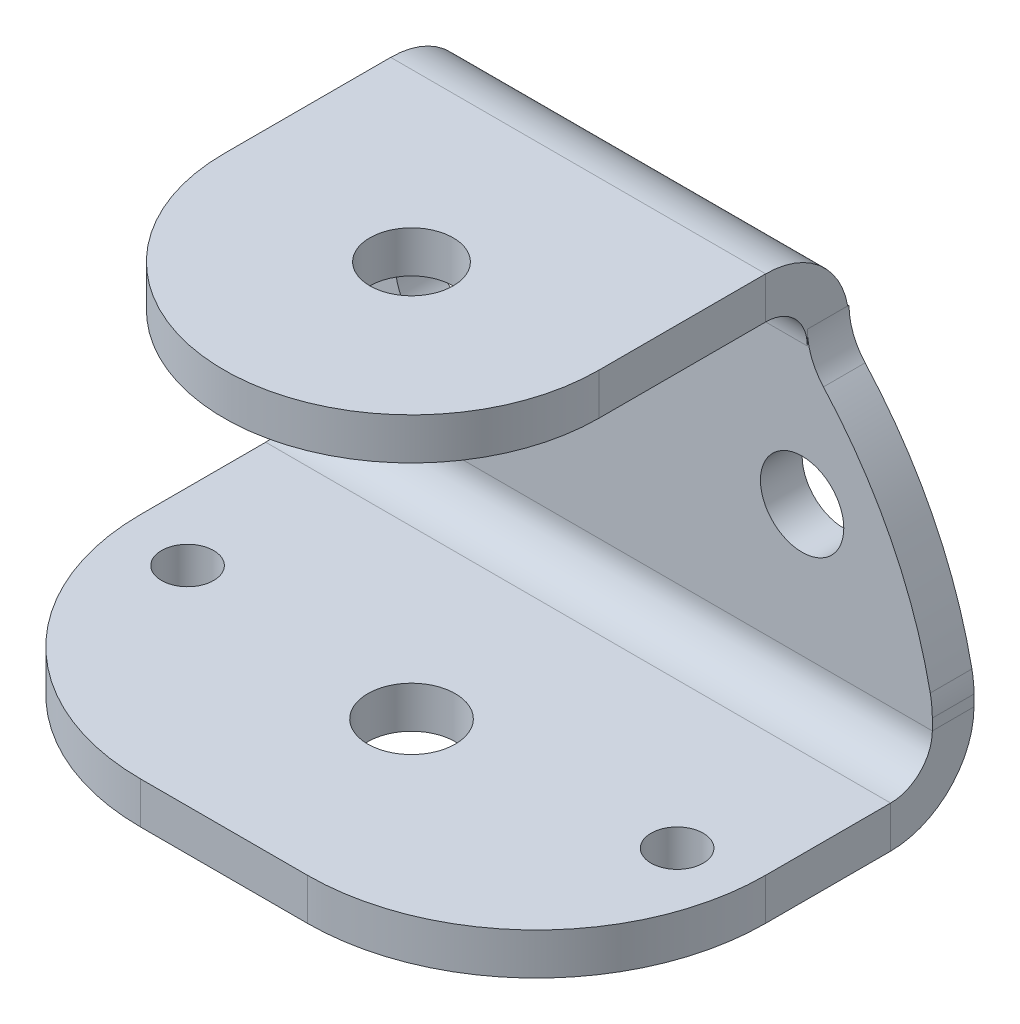
ISO-10303-21;
HEADER;
FILE_DESCRIPTION(('STEP AP214'),'2;1');
FILE_NAME('part.step','',(''),(''),'','','');
FILE_SCHEMA(('AUTOMOTIVE_DESIGN { 1 0 10303 214 1 1 1 1 }'));
ENDSEC;
DATA;
#1=APPLICATION_CONTEXT('core data for automotive mechanical design processes');
#2=APPLICATION_PROTOCOL_DEFINITION('international standard','automotive_design',2000,#1);
#3=PRODUCT_CONTEXT('',#1,'mechanical');
#4=PRODUCT('Part','Part','',(#3));
#5=PRODUCT_RELATED_PRODUCT_CATEGORY('part','',(#4));
#6=PRODUCT_DEFINITION_FORMATION('','',#4);
#7=PRODUCT_DEFINITION_CONTEXT('part definition',#1,'design');
#8=PRODUCT_DEFINITION('design','',#6,#7);
#9=PRODUCT_DEFINITION_SHAPE('','',#8);
#10=(LENGTH_UNIT() NAMED_UNIT(*) SI_UNIT(.MILLI.,.METRE.));
#11=(NAMED_UNIT(*) PLANE_ANGLE_UNIT() SI_UNIT($,.RADIAN.));
#12=(NAMED_UNIT(*) SI_UNIT($,.STERADIAN.) SOLID_ANGLE_UNIT());
#13=UNCERTAINTY_MEASURE_WITH_UNIT(LENGTH_MEASURE(1.E-05),#10,'distance_accuracy_value','');
#14=(GEOMETRIC_REPRESENTATION_CONTEXT(3) GLOBAL_UNCERTAINTY_ASSIGNED_CONTEXT((#13)) GLOBAL_UNIT_ASSIGNED_CONTEXT((#10,
#11,#12)) REPRESENTATION_CONTEXT('',''));
#15=CARTESIAN_POINT('',(0.,0.,0.));
#16=DIRECTION('',(0.,0.,1.));
#17=DIRECTION('',(1.,0.,0.));
#18=AXIS2_PLACEMENT_3D('',#15,#16,#17);
#19=CARTESIAN_POINT('',(15.,19.,9.99999999999999));
#20=DIRECTION('',(0.,1.,0.));
#21=DIRECTION('',(0.,0.,1.));
#22=AXIS2_PLACEMENT_3D('',#19,#20,#21);
#23=PLANE('',#22);
#24=DIRECTION('',(0.,0.,-1.));
#25=VECTOR('',#24,1.);
#26=CARTESIAN_POINT('',(24.,19.,0.));
#27=LINE('',#26,#25);
#28=CARTESIAN_POINT('',(24.,19.,9.99999999999999));
#29=VERTEX_POINT('',#28);
#30=CARTESIAN_POINT('',(24.,19.,1.99999999999999));
#31=VERTEX_POINT('',#30);
#32=EDGE_CURVE('E210',#29,#31,#27,.T.);
#33=ORIENTED_EDGE('',*,*,#32,.T.);
#34=DIRECTION('',(-1.,0.,0.));
#35=VECTOR('',#34,1.);
#36=CARTESIAN_POINT('',(15.,19.,1.99999999999999));
#37=LINE('',#36,#35);
#38=CARTESIAN_POINT('',(6.,19.,1.99999999999999));
#39=VERTEX_POINT('',#38);
#40=EDGE_CURVE('E207',#31,#39,#37,.T.);
#41=ORIENTED_EDGE('',*,*,#40,.T.);
#42=DIRECTION('',(0.,0.,1.));
#43=VECTOR('',#42,1.);
#44=CARTESIAN_POINT('',(6.,19.,10.));
#45=LINE('',#44,#43);
#46=CARTESIAN_POINT('',(6.,19.,10.));
#47=VERTEX_POINT('',#46);
#48=EDGE_CURVE('E199',#39,#47,#45,.T.);
#49=ORIENTED_EDGE('',*,*,#48,.T.);
#50=CARTESIAN_POINT('',(15.,19.,9.99999999999999));
#51=DIRECTION('',(0.,1.,0.));
#52=DIRECTION('',(0.,0.,1.));
#53=AXIS2_PLACEMENT_3D('',#50,#51,#52);
#54=CIRCLE('',#53,9.);
#55=EDGE_CURVE('E204',#47,#29,#54,.T.);
#56=ORIENTED_EDGE('',*,*,#55,.T.);
#57=EDGE_LOOP('',(#33,#41,#49,#56));
#58=FACE_BOUND('',#57,.T.);
#59=CARTESIAN_POINT('',(15.,19.,10.0000000000001));
#60=DIRECTION('',(0.,1.,0.));
#61=DIRECTION('',(0.,0.,1.));
#62=AXIS2_PLACEMENT_3D('',#59,#60,#61);
#63=CIRCLE('',#62,2.);
#64=CARTESIAN_POINT('',(15.,19.,12.0000000000001));
#65=VERTEX_POINT('',#64);
#66=EDGE_CURVE('E909',#65,#65,#63,.T.);
#67=ORIENTED_EDGE('',*,*,#66,.F.);
#68=EDGE_LOOP('',(#67));
#69=FACE_BOUND('',#68,.T.);
#70=ADVANCED_FACE('F42',(#58,#69),#23,.T.);
#71=CARTESIAN_POINT('',(15.,17.,10.));
#72=DIRECTION('',(0.,1.,0.));
#73=DIRECTION('',(0.,0.,1.));
#74=AXIS2_PLACEMENT_3D('',#71,#72,#73);
#75=PLANE('',#74);
#76=DIRECTION('',(-1.,0.,0.));
#77=VECTOR('',#76,1.);
#78=CARTESIAN_POINT('',(24.,17.,1.99999999999999));
#79=LINE('',#78,#77);
#80=CARTESIAN_POINT('',(24.,17.,1.99999999999999));
#81=VERTEX_POINT('',#80);
#82=CARTESIAN_POINT('',(6.,17.,1.99999999999999));
#83=VERTEX_POINT('',#82);
#84=EDGE_CURVE('E868',#81,#83,#79,.T.);
#85=ORIENTED_EDGE('',*,*,#84,.F.);
#86=DIRECTION('',(0.,0.,-1.));
#87=VECTOR('',#86,1.);
#88=CARTESIAN_POINT('',(24.,17.,0.));
#89=LINE('',#88,#87);
#90=CARTESIAN_POINT('',(24.,17.,10.));
#91=VERTEX_POINT('',#90);
#92=EDGE_CURVE('E229',#91,#81,#89,.T.);
#93=ORIENTED_EDGE('',*,*,#92,.F.);
#94=CARTESIAN_POINT('',(15.,17.,10.));
#95=DIRECTION('',(0.,1.,0.));
#96=DIRECTION('',(0.,0.,1.));
#97=AXIS2_PLACEMENT_3D('',#94,#95,#96);
#98=CIRCLE('',#97,9.);
#99=CARTESIAN_POINT('',(6.,17.,10.));
#100=VERTEX_POINT('',#99);
#101=EDGE_CURVE('E233',#100,#91,#98,.T.);
#102=ORIENTED_EDGE('',*,*,#101,.F.);
#103=DIRECTION('',(0.,0.,1.));
#104=VECTOR('',#103,1.);
#105=CARTESIAN_POINT('',(6.,17.,10.));
#106=LINE('',#105,#104);
#107=EDGE_CURVE('E216',#83,#100,#106,.T.);
#108=ORIENTED_EDGE('',*,*,#107,.F.);
#109=EDGE_LOOP('',(#85,#93,#102,#108));
#110=FACE_BOUND('',#109,.T.);
#111=CARTESIAN_POINT('',(15.,17.,10.0000000000001));
#112=DIRECTION('',(0.,1.,0.));
#113=DIRECTION('',(0.,0.,1.));
#114=AXIS2_PLACEMENT_3D('',#111,#112,#113);
#115=CIRCLE('',#114,2.);
#116=CARTESIAN_POINT('',(15.,17.,12.0000000000001));
#117=VERTEX_POINT('',#116);
#118=EDGE_CURVE('E912',#117,#117,#115,.T.);
#119=ORIENTED_EDGE('',*,*,#118,.T.);
#120=EDGE_LOOP('',(#119));
#121=FACE_BOUND('',#120,.T.);
#122=ADVANCED_FACE('F438',(#110,#121),#75,.F.);
#123=CARTESIAN_POINT('',(24.,15.,0.));
#124=DIRECTION('',(-1.,0.,0.));
#125=DIRECTION('',(0.,0.,1.));
#126=AXIS2_PLACEMENT_3D('',#123,#124,#125);
#127=PLANE('',#126);
#128=DIRECTION('',(0.,-1.,0.));
#129=VECTOR('',#128,1.);
#130=CARTESIAN_POINT('',(24.,-0.747058324957094,-2.));
#131=LINE('',#130,#129);
#132=CARTESIAN_POINT('',(24.,15.6981268922314,-2.));
#133=VERTEX_POINT('',#132);
#134=CARTESIAN_POINT('',(24.,15.,-2.));
#135=VERTEX_POINT('',#134);
#136=EDGE_CURVE('E255',#133,#135,#131,.T.);
#137=ORIENTED_EDGE('',*,*,#136,.T.);
#138=CARTESIAN_POINT('',(24.,15.,2.));
#139=DIRECTION('',(-1.,0.,0.));
#140=DIRECTION('',(0.,0.,1.));
#141=AXIS2_PLACEMENT_3D('',#138,#139,#140);
#142=CIRCLE('',#141,4.);
#143=CARTESIAN_POINT('',(24.,15.6981268922314,-1.93860620554318));
#144=VERTEX_POINT('',#143);
#145=EDGE_CURVE('E239',#135,#144,#142,.F.);
#146=ORIENTED_EDGE('',*,*,#145,.T.);
#147=DIRECTION('',(0.,0.,-1.));
#148=VECTOR('',#147,1.);
#149=CARTESIAN_POINT('',(24.,15.6981268922314,-2.));
#150=LINE('',#149,#148);
#151=EDGE_CURVE('E358',#144,#133,#150,.T.);
#152=ORIENTED_EDGE('',*,*,#151,.T.);
#153=EDGE_LOOP('',(#137,#146,#152));
#154=FACE_BOUND('',#153,.T.);
#155=ADVANCED_FACE('F443',(#154),#127,.T.);
#156=CARTESIAN_POINT('',(30.,0.,-2.));
#157=DIRECTION('',(1.,0.,0.));
#158=DIRECTION('',(0.,0.,-1.));
#159=AXIS2_PLACEMENT_3D('',#156,#157,#158);
#160=PLANE('',#159);
#161=DIRECTION('',(0.,1.,0.));
#162=VECTOR('',#161,1.);
#163=CARTESIAN_POINT('',(30.,0.,0.));
#164=LINE('',#163,#162);
#165=CARTESIAN_POINT('',(30.,1.99999999999999,0.));
#166=VERTEX_POINT('',#165);
#167=CARTESIAN_POINT('',(30.,2.53240768629767,0.));
#168=VERTEX_POINT('',#167);
#169=EDGE_CURVE('E324',#166,#168,#164,.T.);
#170=ORIENTED_EDGE('',*,*,#169,.F.);
#171=DIRECTION('',(0.,0.,-1.));
#172=VECTOR('',#171,1.);
#173=CARTESIAN_POINT('',(30.,1.99999999999999,0.));
#174=LINE('',#173,#172);
#175=CARTESIAN_POINT('',(30.,1.99999999999999,-2.));
#176=VERTEX_POINT('',#175);
#177=EDGE_CURVE('E293',#166,#176,#174,.T.);
#178=ORIENTED_EDGE('',*,*,#177,.T.);
#179=DIRECTION('',(0.,1.,0.));
#180=VECTOR('',#179,1.);
#181=CARTESIAN_POINT('',(30.,0.,-2.));
#182=LINE('',#181,#180);
#183=CARTESIAN_POINT('',(30.,2.53240768629767,-2.));
#184=VERTEX_POINT('',#183);
#185=EDGE_CURVE('E313',#176,#184,#182,.T.);
#186=ORIENTED_EDGE('',*,*,#185,.T.);
#187=DIRECTION('',(0.,0.,1.));
#188=VECTOR('',#187,1.);
#189=CARTESIAN_POINT('',(30.,2.53240768629767,-2.));
#190=LINE('',#189,#188);
#191=EDGE_CURVE('E321',#184,#168,#190,.T.);
#192=ORIENTED_EDGE('',*,*,#191,.T.);
#193=EDGE_LOOP('',(#170,#178,#186,#192));
#194=FACE_BOUND('',#193,.T.);
#195=ADVANCED_FACE('F477',(#194),#160,.T.);
#196=CARTESIAN_POINT('',(8.79730487716558,-0.747058324957094,-2.));
#197=DIRECTION('',(0.,0.,1.));
#198=DIRECTION('',(1.,0.,0.));
#199=AXIS2_PLACEMENT_3D('',#196,#197,#198);
#200=PLANE('',#199);
#201=CARTESIAN_POINT('',(23.75,8.29999999999993,-2.));
#202=DIRECTION('',(0.,0.,-1.));
#203=DIRECTION('',(-1.,0.,0.));
#204=AXIS2_PLACEMENT_3D('',#201,#202,#203);
#205=CIRCLE('',#204,2.);
#206=CARTESIAN_POINT('',(21.75,8.29999999999993,-2.));
#207=VERTEX_POINT('',#206);
#208=EDGE_CURVE('E883',#207,#207,#205,.T.);
#209=ORIENTED_EDGE('',*,*,#208,.F.);
#210=EDGE_LOOP('',(#209));
#211=FACE_BOUND('',#210,.T.);
#212=CARTESIAN_POINT('',(6.25,8.29999999999994,-2.));
#213=DIRECTION('',(0.,0.,-1.));
#214=DIRECTION('',(-1.,0.,0.));
#215=AXIS2_PLACEMENT_3D('',#212,#213,#214);
#216=CIRCLE('',#215,2.);
#217=CARTESIAN_POINT('',(4.25,8.29999999999994,-2.));
#218=VERTEX_POINT('',#217);
#219=EDGE_CURVE('E877',#218,#218,#216,.T.);
#220=ORIENTED_EDGE('',*,*,#219,.F.);
#221=EDGE_LOOP('',(#220));
#222=FACE_BOUND('',#221,.T.);
#223=CARTESIAN_POINT('',(3.,15.6981268922314,-2.));
#224=DIRECTION('',(0.,0.,1.));
#225=DIRECTION('',(1.,0.,0.));
#226=AXIS2_PLACEMENT_3D('',#223,#224,#225);
#227=CIRCLE('',#226,3.);
#228=CARTESIAN_POINT('',(5.22606207871607,13.6869959612122,-2.));
#229=VERTEX_POINT('',#228);
#230=CARTESIAN_POINT('',(6.,15.6981268922314,-2.));
#231=VERTEX_POINT('',#230);
#232=EDGE_CURVE('E364',#229,#231,#227,.T.);
#233=ORIENTED_EDGE('',*,*,#232,.T.);
#234=DIRECTION('',(0.,-1.,0.));
#235=VECTOR('',#234,1.);
#236=CARTESIAN_POINT('',(6.,-0.747058324957094,-2.));
#237=LINE('',#236,#235);
#238=CARTESIAN_POINT('',(6.,15.,-2.));
#239=VERTEX_POINT('',#238);
#240=EDGE_CURVE('E260',#231,#239,#237,.T.);
#241=ORIENTED_EDGE('',*,*,#240,.T.);
#242=DIRECTION('',(-1.,0.,0.));
#243=VECTOR('',#242,1.);
#244=CARTESIAN_POINT('',(6.,15.,-2.));
#245=LINE('',#244,#243);
#246=EDGE_CURVE('E235',#239,#135,#245,.F.);
#247=ORIENTED_EDGE('',*,*,#246,.T.);
#248=ORIENTED_EDGE('',*,*,#136,.F.);
#249=CARTESIAN_POINT('',(27.,15.6981268922314,-2.));
#250=DIRECTION('',(0.,0.,1.));
#251=DIRECTION('',(1.,0.,0.));
#252=AXIS2_PLACEMENT_3D('',#249,#250,#251);
#253=CIRCLE('',#252,3.);
#254=CARTESIAN_POINT('',(24.7739379212839,13.6869959612122,-2.));
#255=VERTEX_POINT('',#254);
#256=EDGE_CURVE('E369',#133,#255,#253,.T.);
#257=ORIENTED_EDGE('',*,*,#256,.T.);
#258=CARTESIAN_POINT('',(8.79730487716558,-0.747058324957094,-2.));
#259=DIRECTION('',(0.,0.,1.));
#260=DIRECTION('',(1.,0.,0.));
#261=AXIS2_PLACEMENT_3D('',#258,#259,#260);
#262=CIRCLE('',#261,21.5312499999999);
#263=CARTESIAN_POINT('',(29.9006261241087,3.52430666890781,-2.));
#264=VERTEX_POINT('',#263);
#265=EDGE_CURVE('E316',#264,#255,#262,.T.);
#266=ORIENTED_EDGE('',*,*,#265,.F.);
#267=CARTESIAN_POINT('',(25.,2.53240768629767,-2.));
#268=DIRECTION('',(0.,0.,1.));
#269=DIRECTION('',(1.,0.,0.));
#270=AXIS2_PLACEMENT_3D('',#267,#268,#269);
#271=CIRCLE('',#270,5.);
#272=EDGE_CURVE('E341',#264,#184,#271,.F.);
#273=ORIENTED_EDGE('',*,*,#272,.T.);
#274=ORIENTED_EDGE('',*,*,#185,.F.);
#275=DIRECTION('',(1.,0.,0.));
#276=VECTOR('',#275,1.);
#277=CARTESIAN_POINT('',(30.,1.99999999999999,-2.));
#278=LINE('',#277,#276);
#279=CARTESIAN_POINT('',(0.,2.00000000000001,-2.));
#280=VERTEX_POINT('',#279);
#281=EDGE_CURVE('E287',#176,#280,#278,.F.);
#282=ORIENTED_EDGE('',*,*,#281,.T.);
#283=DIRECTION('',(0.,-1.,0.));
#284=VECTOR('',#283,1.);
#285=CARTESIAN_POINT('',(0.,3.,-2.));
#286=LINE('',#285,#284);
#287=CARTESIAN_POINT('',(0.,2.53240768629769,-2.));
#288=VERTEX_POINT('',#287);
#289=EDGE_CURVE('E310',#288,#280,#286,.T.);
#290=ORIENTED_EDGE('',*,*,#289,.F.);
#291=CARTESIAN_POINT('',(5.,2.53240768629769,-2.));
#292=DIRECTION('',(0.,0.,1.));
#293=DIRECTION('',(1.,0.,0.));
#294=AXIS2_PLACEMENT_3D('',#291,#292,#293);
#295=CIRCLE('',#294,5.);
#296=CARTESIAN_POINT('',(0.0993738758912691,3.52430666890783,-2.));
#297=VERTEX_POINT('',#296);
#298=EDGE_CURVE('E338',#288,#297,#295,.F.);
#299=ORIENTED_EDGE('',*,*,#298,.T.);
#300=CARTESIAN_POINT('',(21.2026951228344,-0.747058324957094,-2.));
#301=DIRECTION('',(0.,0.,1.));
#302=DIRECTION('',(-1.,0.,0.));
#303=AXIS2_PLACEMENT_3D('',#300,#301,#302);
#304=CIRCLE('',#303,21.5312499999999);
#305=EDGE_CURVE('E319',#229,#297,#304,.T.);
#306=ORIENTED_EDGE('',*,*,#305,.F.);
#307=EDGE_LOOP('',(#233,#241,#247,#248,#257,#266,#273,#274,#282,#290,#299,#306));
#308=FACE_BOUND('',#307,.T.);
#309=ADVANCED_FACE('F741',(#211,#222,#308),#200,.F.);
#310=CARTESIAN_POINT('',(8.79730487716558,-0.747058324957094,0.));
#311=DIRECTION('',(0.,0.,1.));
#312=DIRECTION('',(1.,0.,0.));
#313=AXIS2_PLACEMENT_3D('',#310,#311,#312);
#314=PLANE('',#313);
#315=CARTESIAN_POINT('',(23.75,8.29999999999993,0.));
#316=DIRECTION('',(0.,0.,1.));
#317=DIRECTION('',(1.,0.,0.));
#318=AXIS2_PLACEMENT_3D('',#315,#316,#317);
#319=CIRCLE('',#318,2.);
#320=CARTESIAN_POINT('',(25.75,8.29999999999993,0.));
#321=VERTEX_POINT('',#320);
#322=EDGE_CURVE('E886',#321,#321,#319,.F.);
#323=ORIENTED_EDGE('',*,*,#322,.T.);
#324=EDGE_LOOP('',(#323));
#325=FACE_BOUND('',#324,.T.);
#326=CARTESIAN_POINT('',(6.25,8.29999999999994,0.));
#327=DIRECTION('',(0.,0.,1.));
#328=DIRECTION('',(1.,0.,0.));
#329=AXIS2_PLACEMENT_3D('',#326,#327,#328);
#330=CIRCLE('',#329,2.);
#331=CARTESIAN_POINT('',(8.25,8.29999999999994,0.));
#332=VERTEX_POINT('',#331);
#333=EDGE_CURVE('E880',#332,#332,#330,.F.);
#334=ORIENTED_EDGE('',*,*,#333,.T.);
#335=EDGE_LOOP('',(#334));
#336=FACE_BOUND('',#335,.T.);
#337=DIRECTION('',(0.,1.,0.));
#338=VECTOR('',#337,1.);
#339=CARTESIAN_POINT('',(6.,15.,0.));
#340=LINE('',#339,#338);
#341=CARTESIAN_POINT('',(6.,15.,0.));
#342=VERTEX_POINT('',#341);
#343=CARTESIAN_POINT('',(6.,15.6981268922314,0.));
#344=VERTEX_POINT('',#343);
#345=EDGE_CURVE('E253',#342,#344,#340,.T.);
#346=ORIENTED_EDGE('',*,*,#345,.T.);
#347=CARTESIAN_POINT('',(3.,15.6981268922314,0.));
#348=DIRECTION('',(0.,0.,1.));
#349=DIRECTION('',(1.,0.,0.));
#350=AXIS2_PLACEMENT_3D('',#347,#348,#349);
#351=CIRCLE('',#350,3.);
#352=CARTESIAN_POINT('',(5.22606207871607,13.6869959612122,0.));
#353=VERTEX_POINT('',#352);
#354=EDGE_CURVE('E362',#344,#353,#351,.F.);
#355=ORIENTED_EDGE('',*,*,#354,.T.);
#356=CARTESIAN_POINT('',(21.2026951228344,-0.747058324957094,0.));
#357=DIRECTION('',(0.,0.,1.));
#358=DIRECTION('',(-1.,0.,0.));
#359=AXIS2_PLACEMENT_3D('',#356,#357,#358);
#360=CIRCLE('',#359,21.5312499999999);
#361=CARTESIAN_POINT('',(0.0993738758912691,3.52430666890783,0.));
#362=VERTEX_POINT('',#361);
#363=EDGE_CURVE('E314',#353,#362,#360,.T.);
#364=ORIENTED_EDGE('',*,*,#363,.T.);
#365=CARTESIAN_POINT('',(5.,2.53240768629769,0.));
#366=DIRECTION('',(0.,0.,1.));
#367=DIRECTION('',(1.,0.,0.));
#368=AXIS2_PLACEMENT_3D('',#365,#366,#367);
#369=CIRCLE('',#368,5.);
#370=CARTESIAN_POINT('',(0.,2.53240768629769,0.));
#371=VERTEX_POINT('',#370);
#372=EDGE_CURVE('E332',#362,#371,#369,.T.);
#373=ORIENTED_EDGE('',*,*,#372,.T.);
#374=DIRECTION('',(0.,-1.,0.));
#375=VECTOR('',#374,1.);
#376=CARTESIAN_POINT('',(0.,3.,0.));
#377=LINE('',#376,#375);
#378=CARTESIAN_POINT('',(0.,1.99999999999999,0.));
#379=VERTEX_POINT('',#378);
#380=EDGE_CURVE('E307',#371,#379,#377,.T.);
#381=ORIENTED_EDGE('',*,*,#380,.T.);
#382=DIRECTION('',(1.,0.,0.));
#383=VECTOR('',#382,1.);
#384=CARTESIAN_POINT('',(30.,1.99999999999999,0.));
#385=LINE('',#384,#383);
#386=EDGE_CURVE('E299',#166,#379,#385,.F.);
#387=ORIENTED_EDGE('',*,*,#386,.F.);
#388=ORIENTED_EDGE('',*,*,#169,.T.);
#389=CARTESIAN_POINT('',(25.,2.53240768629767,0.));
#390=DIRECTION('',(0.,0.,1.));
#391=DIRECTION('',(1.,0.,0.));
#392=AXIS2_PLACEMENT_3D('',#389,#390,#391);
#393=CIRCLE('',#392,5.);
#394=CARTESIAN_POINT('',(29.9006261241087,3.52430666890781,0.));
#395=VERTEX_POINT('',#394);
#396=EDGE_CURVE('E334',#168,#395,#393,.T.);
#397=ORIENTED_EDGE('',*,*,#396,.T.);
#398=CARTESIAN_POINT('',(8.79730487716558,-0.747058324957094,0.));
#399=DIRECTION('',(0.,0.,1.));
#400=DIRECTION('',(1.,0.,0.));
#401=AXIS2_PLACEMENT_3D('',#398,#399,#400);
#402=CIRCLE('',#401,21.5312499999999);
#403=CARTESIAN_POINT('',(24.7739379212839,13.6869959612122,0.));
#404=VERTEX_POINT('',#403);
#405=EDGE_CURVE('E326',#395,#404,#402,.T.);
#406=ORIENTED_EDGE('',*,*,#405,.T.);
#407=CARTESIAN_POINT('',(27.,15.6981268922314,0.));
#408=DIRECTION('',(0.,0.,1.));
#409=DIRECTION('',(1.,0.,0.));
#410=AXIS2_PLACEMENT_3D('',#407,#408,#409);
#411=CIRCLE('',#410,3.);
#412=CARTESIAN_POINT('',(24.,15.6981268922314,0.));
#413=VERTEX_POINT('',#412);
#414=EDGE_CURVE('E366',#404,#413,#411,.F.);
#415=ORIENTED_EDGE('',*,*,#414,.T.);
#416=DIRECTION('',(0.,1.,0.));
#417=VECTOR('',#416,1.);
#418=CARTESIAN_POINT('',(24.,15.,0.));
#419=LINE('',#418,#417);
#420=CARTESIAN_POINT('',(24.,15.,0.));
#421=VERTEX_POINT('',#420);
#422=EDGE_CURVE('E241',#421,#413,#419,.T.);
#423=ORIENTED_EDGE('',*,*,#422,.F.);
#424=DIRECTION('',(-1.,0.,0.));
#425=VECTOR('',#424,1.);
#426=CARTESIAN_POINT('',(6.,15.,0.));
#427=LINE('',#426,#425);
#428=EDGE_CURVE('E248',#342,#421,#427,.F.);
#429=ORIENTED_EDGE('',*,*,#428,.F.);
#430=EDGE_LOOP('',(#346,#355,#364,#373,#381,#387,#388,#397,#406,#415,#423,#429));
#431=FACE_BOUND('',#430,.T.);
#432=ADVANCED_FACE('F423',(#325,#336,#431),#314,.T.);
#433=CARTESIAN_POINT('',(0.,3.,-2.));
#434=DIRECTION('',(-1.,0.,0.));
#435=DIRECTION('',(0.,-1.,0.));
#436=AXIS2_PLACEMENT_3D('',#433,#434,#435);
#437=PLANE('',#436);
#438=DIRECTION('',(0.,0.,-1.));
#439=VECTOR('',#438,1.);
#440=CARTESIAN_POINT('',(0.,1.99999999999999,0.));
#441=LINE('',#440,#439);
#442=EDGE_CURVE('E304',#379,#280,#441,.T.);
#443=ORIENTED_EDGE('',*,*,#442,.F.);
#444=ORIENTED_EDGE('',*,*,#380,.F.);
#445=DIRECTION('',(0.,0.,1.));
#446=VECTOR('',#445,1.);
#447=CARTESIAN_POINT('',(0.,2.53240768629769,-2.));
#448=LINE('',#447,#446);
#449=EDGE_CURVE('E347',#371,#288,#448,.F.);
#450=ORIENTED_EDGE('',*,*,#449,.T.);
#451=ORIENTED_EDGE('',*,*,#289,.T.);
#452=EDGE_LOOP('',(#443,#444,#450,#451));
#453=FACE_BOUND('',#452,.T.);
#454=ADVANCED_FACE('F419',(#453),#437,.T.);
#455=CARTESIAN_POINT('',(21.2026951228344,-0.747058324957094,-2.));
#456=DIRECTION('',(0.,0.,1.));
#457=DIRECTION('',(1.,0.,0.));
#458=AXIS2_PLACEMENT_3D('',#455,#456,#457);
#459=CYLINDRICAL_SURFACE('',#458,21.5312499999999);
#460=ORIENTED_EDGE('',*,*,#363,.F.);
#461=DIRECTION('',(0.,0.,1.));
#462=VECTOR('',#461,1.);
#463=CARTESIAN_POINT('',(5.22606207871607,13.6869959612122,-2.));
#464=LINE('',#463,#462);
#465=EDGE_CURVE('E353',#353,#229,#464,.F.);
#466=ORIENTED_EDGE('',*,*,#465,.T.);
#467=ORIENTED_EDGE('',*,*,#305,.T.);
#468=DIRECTION('',(0.,0.,1.));
#469=VECTOR('',#468,1.);
#470=CARTESIAN_POINT('',(0.0993738758912691,3.52430666890783,-2.));
#471=LINE('',#470,#469);
#472=EDGE_CURVE('E344',#297,#362,#471,.T.);
#473=ORIENTED_EDGE('',*,*,#472,.T.);
#474=EDGE_LOOP('',(#460,#466,#467,#473));
#475=FACE_BOUND('',#474,.T.);
#476=ADVANCED_FACE('F803',(#475),#459,.T.);
#477=CARTESIAN_POINT('',(8.79730487716558,-0.747058324957094,-2.));
#478=DIRECTION('',(0.,0.,1.));
#479=DIRECTION('',(1.,0.,0.));
#480=AXIS2_PLACEMENT_3D('',#477,#478,#479);
#481=CYLINDRICAL_SURFACE('',#480,21.5312499999999);
#482=ORIENTED_EDGE('',*,*,#265,.T.);
#483=DIRECTION('',(0.,0.,1.));
#484=VECTOR('',#483,1.);
#485=CARTESIAN_POINT('',(24.7739379212839,13.6869959612122,-2.));
#486=LINE('',#485,#484);
#487=EDGE_CURVE('E355',#255,#404,#486,.T.);
#488=ORIENTED_EDGE('',*,*,#487,.T.);
#489=ORIENTED_EDGE('',*,*,#405,.F.);
#490=DIRECTION('',(0.,0.,1.));
#491=VECTOR('',#490,1.);
#492=CARTESIAN_POINT('',(29.9006261241087,3.52430666890781,-2.));
#493=LINE('',#492,#491);
#494=EDGE_CURVE('E336',#395,#264,#493,.F.);
#495=ORIENTED_EDGE('',*,*,#494,.T.);
#496=EDGE_LOOP('',(#482,#488,#489,#495));
#497=FACE_BOUND('',#496,.T.);
#498=ADVANCED_FACE('F794',(#497),#481,.T.);
#499=CARTESIAN_POINT('',(25.,2.53240768629767,-2.));
#500=DIRECTION('',(0.,0.,1.));
#501=DIRECTION('',(1.,0.,0.));
#502=AXIS2_PLACEMENT_3D('',#499,#500,#501);
#503=CYLINDRICAL_SURFACE('',#502,5.);
#504=ORIENTED_EDGE('',*,*,#272,.F.);
#505=ORIENTED_EDGE('',*,*,#494,.F.);
#506=ORIENTED_EDGE('',*,*,#396,.F.);
#507=ORIENTED_EDGE('',*,*,#191,.F.);
#508=EDGE_LOOP('',(#504,#505,#506,#507));
#509=FACE_BOUND('',#508,.T.);
#510=ADVANCED_FACE('F784',(#509),#503,.T.);
#511=CARTESIAN_POINT('',(5.,2.53240768629769,-2.));
#512=DIRECTION('',(0.,0.,1.));
#513=DIRECTION('',(1.,0.,0.));
#514=AXIS2_PLACEMENT_3D('',#511,#512,#513);
#515=CYLINDRICAL_SURFACE('',#514,5.);
#516=ORIENTED_EDGE('',*,*,#298,.F.);
#517=ORIENTED_EDGE('',*,*,#449,.F.);
#518=ORIENTED_EDGE('',*,*,#372,.F.);
#519=ORIENTED_EDGE('',*,*,#472,.F.);
#520=EDGE_LOOP('',(#516,#517,#518,#519));
#521=FACE_BOUND('',#520,.T.);
#522=ADVANCED_FACE('F775',(#521),#515,.T.);
#523=CARTESIAN_POINT('',(3.,15.6981268922314,-2.));
#524=DIRECTION('',(0.,0.,1.));
#525=DIRECTION('',(1.,0.,0.));
#526=AXIS2_PLACEMENT_3D('',#523,#524,#525);
#527=CYLINDRICAL_SURFACE('',#526,3.);
#528=ORIENTED_EDGE('',*,*,#232,.F.);
#529=ORIENTED_EDGE('',*,*,#465,.F.);
#530=ORIENTED_EDGE('',*,*,#354,.F.);
#531=DIRECTION('',(0.,0.,-1.));
#532=VECTOR('',#531,1.);
#533=CARTESIAN_POINT('',(6.,15.6981268922314,0.));
#534=LINE('',#533,#532);
#535=CARTESIAN_POINT('',(6.,15.6981268922314,-1.93860620554318));
#536=VERTEX_POINT('',#535);
#537=EDGE_CURVE('E349',#536,#344,#534,.F.);
#538=ORIENTED_EDGE('',*,*,#537,.F.);
#539=EDGE_CURVE('E350',#231,#536,#534,.F.);
#540=ORIENTED_EDGE('',*,*,#539,.F.);
#541=EDGE_LOOP('',(#528,#529,#530,#538,#540));
#542=FACE_BOUND('',#541,.T.);
#543=ADVANCED_FACE('F767',(#542),#527,.F.);
#544=CARTESIAN_POINT('',(27.,15.6981268922314,-2.));
#545=DIRECTION('',(0.,0.,1.));
#546=DIRECTION('',(1.,0.,0.));
#547=AXIS2_PLACEMENT_3D('',#544,#545,#546);
#548=CYLINDRICAL_SURFACE('',#547,3.);
#549=ORIENTED_EDGE('',*,*,#256,.F.);
#550=ORIENTED_EDGE('',*,*,#151,.F.);
#551=EDGE_CURVE('E359',#413,#144,#150,.T.);
#552=ORIENTED_EDGE('',*,*,#551,.F.);
#553=ORIENTED_EDGE('',*,*,#414,.F.);
#554=ORIENTED_EDGE('',*,*,#487,.F.);
#555=EDGE_LOOP('',(#549,#550,#552,#553,#554));
#556=FACE_BOUND('',#555,.T.);
#557=ADVANCED_FACE('F732',(#556),#548,.F.);
#558=CARTESIAN_POINT('',(0.,1.99999999999999,2.));
#559=DIRECTION('',(-1.,0.,0.));
#560=DIRECTION('',(0.,0.,1.));
#561=AXIS2_PLACEMENT_3D('',#558,#559,#560);
#562=PLANE('',#561);
#563=DIRECTION('',(0.,-1.,0.));
#564=VECTOR('',#563,1.);
#565=CARTESIAN_POINT('',(0.,0.,1.99999999999999));
#566=LINE('',#565,#564);
#567=CARTESIAN_POINT('',(0.,0.,1.99999999999999));
#568=VERTEX_POINT('',#567);
#569=CARTESIAN_POINT('',(0.,-2.00000000000001,1.99999999999999));
#570=VERTEX_POINT('',#569);
#571=EDGE_CURVE('E263',#568,#570,#566,.T.);
#572=ORIENTED_EDGE('',*,*,#571,.F.);
#573=CARTESIAN_POINT('',(0.,1.99999999999999,2.));
#574=DIRECTION('',(1.,0.,0.));
#575=DIRECTION('',(0.,0.,-1.));
#576=AXIS2_PLACEMENT_3D('',#573,#574,#575);
#577=CIRCLE('',#576,2.);
#578=EDGE_CURVE('E296',#379,#568,#577,.F.);
#579=ORIENTED_EDGE('',*,*,#578,.F.);
#580=ORIENTED_EDGE('',*,*,#442,.T.);
#581=CARTESIAN_POINT('',(0.,1.99999999999999,2.));
#582=DIRECTION('',(1.,0.,0.));
#583=DIRECTION('',(0.,0.,-1.));
#584=AXIS2_PLACEMENT_3D('',#581,#582,#583);
#585=CIRCLE('',#584,4.);
#586=EDGE_CURVE('E289',#280,#570,#585,.F.);
#587=ORIENTED_EDGE('',*,*,#586,.T.);
#588=EDGE_LOOP('',(#572,#579,#580,#587));
#589=FACE_BOUND('',#588,.T.);
#590=ADVANCED_FACE('F415',(#589),#562,.T.);
#591=CARTESIAN_POINT('',(30.,1.99999999999999,2.));
#592=DIRECTION('',(-1.,0.,0.));
#593=DIRECTION('',(0.,0.,1.));
#594=AXIS2_PLACEMENT_3D('',#591,#592,#593);
#595=PLANE('',#594);
#596=CARTESIAN_POINT('',(30.,1.99999999999999,2.));
#597=DIRECTION('',(1.,0.,0.));
#598=DIRECTION('',(0.,0.,-1.));
#599=AXIS2_PLACEMENT_3D('',#596,#597,#598);
#600=CIRCLE('',#599,2.);
#601=CARTESIAN_POINT('',(30.,0.,1.99999999999999));
#602=VERTEX_POINT('',#601);
#603=EDGE_CURVE('E282',#602,#166,#600,.T.);
#604=ORIENTED_EDGE('',*,*,#603,.F.);
#605=DIRECTION('',(0.,-1.,0.));
#606=VECTOR('',#605,1.);
#607=CARTESIAN_POINT('',(30.,0.,1.99999999999999));
#608=LINE('',#607,#606);
#609=CARTESIAN_POINT('',(30.,-2.00000000000001,1.99999999999999));
#610=VERTEX_POINT('',#609);
#611=EDGE_CURVE('E266',#602,#610,#608,.T.);
#612=ORIENTED_EDGE('',*,*,#611,.T.);
#613=CARTESIAN_POINT('',(30.,1.99999999999999,2.));
#614=DIRECTION('',(1.,0.,0.));
#615=DIRECTION('',(0.,0.,-1.));
#616=AXIS2_PLACEMENT_3D('',#613,#614,#615);
#617=CIRCLE('',#616,4.);
#618=EDGE_CURVE('E290',#610,#176,#617,.T.);
#619=ORIENTED_EDGE('',*,*,#618,.T.);
#620=ORIENTED_EDGE('',*,*,#177,.F.);
#621=EDGE_LOOP('',(#604,#612,#619,#620));
#622=FACE_BOUND('',#621,.T.);
#623=ADVANCED_FACE('F408',(#622),#595,.F.);
#624=CARTESIAN_POINT('',(30.,1.99999999999999,2.));
#625=DIRECTION('',(1.,0.,0.));
#626=DIRECTION('',(0.,-1.,0.));
#627=AXIS2_PLACEMENT_3D('',#624,#625,#626);
#628=CYLINDRICAL_SURFACE('',#627,4.);
#629=ORIENTED_EDGE('',*,*,#281,.F.);
#630=ORIENTED_EDGE('',*,*,#618,.F.);
#631=DIRECTION('',(-1.,0.,0.));
#632=VECTOR('',#631,1.);
#633=CARTESIAN_POINT('',(0.,-2.00000000000001,1.99999999999999));
#634=LINE('',#633,#632);
#635=EDGE_CURVE('E269',#610,#570,#634,.T.);
#636=ORIENTED_EDGE('',*,*,#635,.T.);
#637=ORIENTED_EDGE('',*,*,#586,.F.);
#638=EDGE_LOOP('',(#629,#630,#636,#637));
#639=FACE_BOUND('',#638,.T.);
#640=ADVANCED_FACE('F413',(#639),#628,.T.);
#641=CARTESIAN_POINT('',(30.,1.99999999999999,2.));
#642=DIRECTION('',(1.,0.,0.));
#643=DIRECTION('',(0.,-1.,0.));
#644=AXIS2_PLACEMENT_3D('',#641,#642,#643);
#645=CYLINDRICAL_SURFACE('',#644,2.);
#646=ORIENTED_EDGE('',*,*,#386,.T.);
#647=ORIENTED_EDGE('',*,*,#578,.T.);
#648=DIRECTION('',(1.,0.,0.));
#649=VECTOR('',#648,1.);
#650=CARTESIAN_POINT('',(0.,0.,1.99999999999999));
#651=LINE('',#650,#649);
#652=EDGE_CURVE('E264',#568,#602,#651,.T.);
#653=ORIENTED_EDGE('',*,*,#652,.T.);
#654=ORIENTED_EDGE('',*,*,#603,.T.);
#655=EDGE_LOOP('',(#646,#647,#653,#654));
#656=FACE_BOUND('',#655,.T.);
#657=ADVANCED_FACE('F427',(#656),#645,.F.);
#658=CARTESIAN_POINT('',(0.,-2.,0.));
#659=DIRECTION('',(1.,0.,0.));
#660=DIRECTION('',(0.,0.,-1.));
#661=AXIS2_PLACEMENT_3D('',#658,#659,#660);
#662=PLANE('',#661);
#663=DIRECTION('',(0.,0.,-1.));
#664=VECTOR('',#663,1.);
#665=CARTESIAN_POINT('',(0.,-2.,0.));
#666=LINE('',#665,#664);
#667=CARTESIAN_POINT('',(0.,-2.00000000000003,7.99999999999999));
#668=VERTEX_POINT('',#667);
#669=EDGE_CURVE('E275',#668,#570,#666,.T.);
#670=ORIENTED_EDGE('',*,*,#669,.F.);
#671=DIRECTION('',(0.,1.,0.));
#672=VECTOR('',#671,1.);
#673=CARTESIAN_POINT('',(0.,-2.00000000000003,7.99999999999999));
#674=LINE('',#673,#672);
#675=CARTESIAN_POINT('',(0.,0.,8.));
#676=VERTEX_POINT('',#675);
#677=EDGE_CURVE('E371',#668,#676,#674,.T.);
#678=ORIENTED_EDGE('',*,*,#677,.T.);
#679=DIRECTION('',(0.,0.,-1.));
#680=VECTOR('',#679,1.);
#681=CARTESIAN_POINT('',(0.,0.,0.));
#682=LINE('',#681,#680);
#683=EDGE_CURVE('E274',#676,#568,#682,.T.);
#684=ORIENTED_EDGE('',*,*,#683,.T.);
#685=ORIENTED_EDGE('',*,*,#571,.T.);
#686=EDGE_LOOP('',(#670,#678,#684,#685));
#687=FACE_BOUND('',#686,.T.);
#688=ADVANCED_FACE('F391',(#687),#662,.F.);
#689=CARTESIAN_POINT('',(30.,-2.00000000000007,19.));
#690=DIRECTION('',(-1.,0.,0.));
#691=DIRECTION('',(0.,0.,1.));
#692=AXIS2_PLACEMENT_3D('',#689,#690,#691);
#693=PLANE('',#692);
#694=DIRECTION('',(0.,0.,1.));
#695=VECTOR('',#694,1.);
#696=CARTESIAN_POINT('',(30.,0.,19.));
#697=LINE('',#696,#695);
#698=CARTESIAN_POINT('',(30.,0.,8.));
#699=VERTEX_POINT('',#698);
#700=EDGE_CURVE('E284',#602,#699,#697,.T.);
#701=ORIENTED_EDGE('',*,*,#700,.T.);
#702=DIRECTION('',(0.,1.,0.));
#703=VECTOR('',#702,1.);
#704=CARTESIAN_POINT('',(30.,-2.00000000000003,7.99999999999999));
#705=LINE('',#704,#703);
#706=CARTESIAN_POINT('',(30.,-2.00000000000003,7.99999999999999));
#707=VERTEX_POINT('',#706);
#708=EDGE_CURVE('E12',#699,#707,#705,.F.);
#709=ORIENTED_EDGE('',*,*,#708,.T.);
#710=DIRECTION('',(0.,0.,1.));
#711=VECTOR('',#710,1.);
#712=CARTESIAN_POINT('',(30.,-2.00000000000007,19.));
#713=LINE('',#712,#711);
#714=EDGE_CURVE('E277',#610,#707,#713,.T.);
#715=ORIENTED_EDGE('',*,*,#714,.F.);
#716=ORIENTED_EDGE('',*,*,#611,.F.);
#717=EDGE_LOOP('',(#701,#709,#715,#716));
#718=FACE_BOUND('',#717,.T.);
#719=ADVANCED_FACE('F405',(#718),#693,.F.);
#720=CARTESIAN_POINT('',(0.,-2.,0.));
#721=DIRECTION('',(0.,1.,0.));
#722=DIRECTION('',(0.,0.,1.));
#723=AXIS2_PLACEMENT_3D('',#720,#721,#722);
#724=PLANE('',#723);
#725=CARTESIAN_POINT('',(15.,-2.00000000000004,9.99999999999999));
#726=DIRECTION('',(0.,1.,0.));
#727=DIRECTION('',(0.,0.,1.));
#728=AXIS2_PLACEMENT_3D('',#725,#726,#727);
#729=CIRCLE('',#728,2.1);
#730=CARTESIAN_POINT('',(15.,-2.00000000000004,12.1));
#731=VERTEX_POINT('',#730);
#732=EDGE_CURVE('E903',#731,#731,#729,.T.);
#733=ORIENTED_EDGE('',*,*,#732,.T.);
#734=EDGE_LOOP('',(#733));
#735=FACE_BOUND('',#734,.T.);
#736=CARTESIAN_POINT('',(3.25,-2.00000000000003,8.99999999999999));
#737=DIRECTION('',(0.,1.,0.));
#738=DIRECTION('',(0.,0.,1.));
#739=AXIS2_PLACEMENT_3D('',#736,#737,#738);
#740=CIRCLE('',#739,1.24999999999999);
#741=CARTESIAN_POINT('',(3.25,-2.00000000000004,10.25));
#742=VERTEX_POINT('',#741);
#743=EDGE_CURVE('E897',#742,#742,#740,.T.);
#744=ORIENTED_EDGE('',*,*,#743,.T.);
#745=EDGE_LOOP('',(#744));
#746=FACE_BOUND('',#745,.T.);
#747=CARTESIAN_POINT('',(26.75,-2.00000000000003,8.99999999999998));
#748=DIRECTION('',(0.,1.,0.));
#749=DIRECTION('',(0.,0.,1.));
#750=AXIS2_PLACEMENT_3D('',#747,#748,#749);
#751=CIRCLE('',#750,1.24999999999999);
#752=CARTESIAN_POINT('',(26.75,-2.00000000000004,10.25));
#753=VERTEX_POINT('',#752);
#754=EDGE_CURVE('E889',#753,#753,#751,.T.);
#755=ORIENTED_EDGE('',*,*,#754,.T.);
#756=EDGE_LOOP('',(#755));
#757=FACE_BOUND('',#756,.T.);
#758=DIRECTION('',(-1.,0.,0.));
#759=VECTOR('',#758,1.);
#760=CARTESIAN_POINT('',(0.,-2.00000000000007,19.));
#761=LINE('',#760,#759);
#762=CARTESIAN_POINT('',(19.,-2.00000000000007,19.));
#763=VERTEX_POINT('',#762);
#764=CARTESIAN_POINT('',(11.,-2.00000000000007,19.));
#765=VERTEX_POINT('',#764);
#766=EDGE_CURVE('E280',#763,#765,#761,.T.);
#767=ORIENTED_EDGE('',*,*,#766,.T.);
#768=CARTESIAN_POINT('',(11.,-2.00000000000003,7.99999999999999));
#769=DIRECTION('',(0.,1.,0.));
#770=DIRECTION('',(0.,0.,1.));
#771=AXIS2_PLACEMENT_3D('',#768,#769,#770);
#772=CIRCLE('',#771,11.);
#773=EDGE_CURVE('E50',#765,#668,#772,.F.);
#774=ORIENTED_EDGE('',*,*,#773,.T.);
#775=ORIENTED_EDGE('',*,*,#669,.T.);
#776=ORIENTED_EDGE('',*,*,#635,.F.);
#777=ORIENTED_EDGE('',*,*,#714,.T.);
#778=CARTESIAN_POINT('',(19.,-2.00000000000003,7.99999999999999));
#779=DIRECTION('',(0.,1.,0.));
#780=DIRECTION('',(0.,0.,1.));
#781=AXIS2_PLACEMENT_3D('',#778,#779,#780);
#782=CIRCLE('',#781,11.);
#783=EDGE_CURVE('E382',#707,#763,#782,.F.);
#784=ORIENTED_EDGE('',*,*,#783,.T.);
#785=EDGE_LOOP('',(#767,#774,#775,#776,#777,#784));
#786=FACE_BOUND('',#785,.T.);
#787=ADVANCED_FACE('F386',(#735,#746,#757,#786),#724,.F.);
#788=CARTESIAN_POINT('',(0.,0.,0.));
#789=DIRECTION('',(0.,1.,0.));
#790=DIRECTION('',(0.,0.,1.));
#791=AXIS2_PLACEMENT_3D('',#788,#789,#790);
#792=PLANE('',#791);
#793=CARTESIAN_POINT('',(15.,0.,9.99999999999999));
#794=DIRECTION('',(0.,1.,0.));
#795=DIRECTION('',(0.,0.,1.));
#796=AXIS2_PLACEMENT_3D('',#793,#794,#795);
#797=CIRCLE('',#796,2.1);
#798=CARTESIAN_POINT('',(15.,0.,12.1));
#799=VERTEX_POINT('',#798);
#800=EDGE_CURVE('E906',#799,#799,#797,.T.);
#801=ORIENTED_EDGE('',*,*,#800,.F.);
#802=EDGE_LOOP('',(#801));
#803=FACE_BOUND('',#802,.T.);
#804=CARTESIAN_POINT('',(3.25,0.,8.99999999999999));
#805=DIRECTION('',(0.,1.,0.));
#806=DIRECTION('',(0.,0.,1.));
#807=AXIS2_PLACEMENT_3D('',#804,#805,#806);
#808=CIRCLE('',#807,1.24999999999999);
#809=CARTESIAN_POINT('',(3.25,0.,10.25));
#810=VERTEX_POINT('',#809);
#811=EDGE_CURVE('E900',#810,#810,#808,.T.);
#812=ORIENTED_EDGE('',*,*,#811,.F.);
#813=EDGE_LOOP('',(#812));
#814=FACE_BOUND('',#813,.T.);
#815=CARTESIAN_POINT('',(26.75,0.,8.99999999999999));
#816=DIRECTION('',(0.,1.,0.));
#817=DIRECTION('',(0.,0.,1.));
#818=AXIS2_PLACEMENT_3D('',#815,#816,#817);
#819=CIRCLE('',#818,1.24999999999999);
#820=CARTESIAN_POINT('',(26.75,0.,10.25));
#821=VERTEX_POINT('',#820);
#822=EDGE_CURVE('E894',#821,#821,#819,.T.);
#823=ORIENTED_EDGE('',*,*,#822,.F.);
#824=EDGE_LOOP('',(#823));
#825=FACE_BOUND('',#824,.T.);
#826=ORIENTED_EDGE('',*,*,#683,.F.);
#827=CARTESIAN_POINT('',(11.,0.,8.));
#828=DIRECTION('',(0.,1.,0.));
#829=DIRECTION('',(0.,0.,1.));
#830=AXIS2_PLACEMENT_3D('',#827,#828,#829);
#831=CIRCLE('',#830,11.);
#832=CARTESIAN_POINT('',(11.,0.,19.));
#833=VERTEX_POINT('',#832);
#834=EDGE_CURVE('E376',#676,#833,#831,.T.);
#835=ORIENTED_EDGE('',*,*,#834,.T.);
#836=DIRECTION('',(-1.,0.,0.));
#837=VECTOR('',#836,1.);
#838=CARTESIAN_POINT('',(0.,0.,19.));
#839=LINE('',#838,#837);
#840=CARTESIAN_POINT('',(19.,0.,19.));
#841=VERTEX_POINT('',#840);
#842=EDGE_CURVE('E278',#841,#833,#839,.T.);
#843=ORIENTED_EDGE('',*,*,#842,.F.);
#844=CARTESIAN_POINT('',(19.,0.,8.));
#845=DIRECTION('',(0.,1.,0.));
#846=DIRECTION('',(0.,0.,1.));
#847=AXIS2_PLACEMENT_3D('',#844,#845,#846);
#848=CIRCLE('',#847,11.);
#849=EDGE_CURVE('E374',#841,#699,#848,.T.);
#850=ORIENTED_EDGE('',*,*,#849,.T.);
#851=ORIENTED_EDGE('',*,*,#700,.F.);
#852=ORIENTED_EDGE('',*,*,#652,.F.);
#853=EDGE_LOOP('',(#826,#835,#843,#850,#851,#852));
#854=FACE_BOUND('',#853,.T.);
#855=ADVANCED_FACE('F397',(#803,#814,#825,#854),#792,.T.);
#856=CARTESIAN_POINT('',(0.,-2.00000000000007,19.));
#857=DIRECTION('',(0.,0.,-1.));
#858=DIRECTION('',(0.,1.,0.));
#859=AXIS2_PLACEMENT_3D('',#856,#857,#858);
#860=PLANE('',#859);
#861=ORIENTED_EDGE('',*,*,#842,.T.);
#862=DIRECTION('',(0.,1.,0.));
#863=VECTOR('',#862,1.);
#864=CARTESIAN_POINT('',(11.,-2.00000000000007,19.));
#865=LINE('',#864,#863);
#866=EDGE_CURVE('E63',#833,#765,#865,.F.);
#867=ORIENTED_EDGE('',*,*,#866,.T.);
#868=ORIENTED_EDGE('',*,*,#766,.F.);
#869=DIRECTION('',(0.,1.,0.));
#870=VECTOR('',#869,1.);
#871=CARTESIAN_POINT('',(19.,-2.00000000000007,19.));
#872=LINE('',#871,#870);
#873=EDGE_CURVE('E378',#763,#841,#872,.T.);
#874=ORIENTED_EDGE('',*,*,#873,.T.);
#875=EDGE_LOOP('',(#861,#867,#868,#874));
#876=FACE_BOUND('',#875,.T.);
#877=ADVANCED_FACE('F399',(#876),#860,.F.);
#878=CARTESIAN_POINT('',(6.,15.,0.));
#879=DIRECTION('',(-1.,0.,0.));
#880=DIRECTION('',(0.,0.,1.));
#881=AXIS2_PLACEMENT_3D('',#878,#879,#880);
#882=PLANE('',#881);
#883=ORIENTED_EDGE('',*,*,#539,.T.);
#884=CARTESIAN_POINT('',(6.,15.,2.));
#885=DIRECTION('',(-1.,0.,0.));
#886=DIRECTION('',(0.,0.,1.));
#887=AXIS2_PLACEMENT_3D('',#884,#885,#886);
#888=CIRCLE('',#887,4.);
#889=EDGE_CURVE('E245',#536,#239,#888,.T.);
#890=ORIENTED_EDGE('',*,*,#889,.T.);
#891=ORIENTED_EDGE('',*,*,#240,.F.);
#892=EDGE_LOOP('',(#883,#890,#891));
#893=FACE_BOUND('',#892,.T.);
#894=ADVANCED_FACE('F470',(#893),#882,.F.);
#895=CARTESIAN_POINT('',(24.,15.,2.));
#896=DIRECTION('',(1.,0.,0.));
#897=DIRECTION('',(0.,0.,-1.));
#898=AXIS2_PLACEMENT_3D('',#895,#896,#897);
#899=PLANE('',#898);
#900=ORIENTED_EDGE('',*,*,#422,.T.);
#901=ORIENTED_EDGE('',*,*,#551,.T.);
#902=EDGE_CURVE('E237',#144,#31,#142,.F.);
#903=ORIENTED_EDGE('',*,*,#902,.T.);
#904=DIRECTION('',(0.,1.,0.));
#905=VECTOR('',#904,1.);
#906=CARTESIAN_POINT('',(24.,17.,1.99999999999999));
#907=LINE('',#906,#905);
#908=EDGE_CURVE('E866',#81,#31,#907,.T.);
#909=ORIENTED_EDGE('',*,*,#908,.F.);
#910=CARTESIAN_POINT('',(24.,15.,2.));
#911=DIRECTION('',(-1.,0.,0.));
#912=DIRECTION('',(0.,0.,1.));
#913=AXIS2_PLACEMENT_3D('',#910,#911,#912);
#914=CIRCLE('',#913,2.);
#915=EDGE_CURVE('E244',#421,#81,#914,.F.);
#916=ORIENTED_EDGE('',*,*,#915,.F.);
#917=EDGE_LOOP('',(#900,#901,#903,#909,#916));
#918=FACE_BOUND('',#917,.T.);
#919=ADVANCED_FACE('F467',(#918),#899,.T.);
#920=CARTESIAN_POINT('',(6.,15.,2.));
#921=DIRECTION('',(1.,0.,0.));
#922=DIRECTION('',(0.,0.,-1.));
#923=AXIS2_PLACEMENT_3D('',#920,#921,#922);
#924=PLANE('',#923);
#925=EDGE_CURVE('E238',#39,#536,#888,.T.);
#926=ORIENTED_EDGE('',*,*,#925,.T.);
#927=ORIENTED_EDGE('',*,*,#537,.T.);
#928=ORIENTED_EDGE('',*,*,#345,.F.);
#929=CARTESIAN_POINT('',(6.,15.,2.));
#930=DIRECTION('',(-1.,0.,0.));
#931=DIRECTION('',(0.,0.,1.));
#932=AXIS2_PLACEMENT_3D('',#929,#930,#931);
#933=CIRCLE('',#932,2.);
#934=EDGE_CURVE('E219',#83,#342,#933,.T.);
#935=ORIENTED_EDGE('',*,*,#934,.F.);
#936=DIRECTION('',(0.,1.,0.));
#937=VECTOR('',#936,1.);
#938=CARTESIAN_POINT('',(6.,17.,1.99999999999999));
#939=LINE('',#938,#937);
#940=EDGE_CURVE('E872',#83,#39,#939,.T.);
#941=ORIENTED_EDGE('',*,*,#940,.T.);
#942=EDGE_LOOP('',(#926,#927,#928,#935,#941));
#943=FACE_BOUND('',#942,.T.);
#944=ADVANCED_FACE('F462',(#943),#924,.F.);
#945=CARTESIAN_POINT('',(6.,15.,2.));
#946=DIRECTION('',(-1.,0.,0.));
#947=DIRECTION('',(0.,1.,0.));
#948=AXIS2_PLACEMENT_3D('',#945,#946,#947);
#949=CYLINDRICAL_SURFACE('',#948,4.);
#950=ORIENTED_EDGE('',*,*,#246,.F.);
#951=ORIENTED_EDGE('',*,*,#889,.F.);
#952=ORIENTED_EDGE('',*,*,#925,.F.);
#953=ORIENTED_EDGE('',*,*,#40,.F.);
#954=ORIENTED_EDGE('',*,*,#902,.F.);
#955=ORIENTED_EDGE('',*,*,#145,.F.);
#956=EDGE_LOOP('',(#950,#951,#952,#953,#954,#955));
#957=FACE_BOUND('',#956,.T.);
#958=ADVANCED_FACE('F459',(#957),#949,.T.);
#959=CARTESIAN_POINT('',(6.,15.,2.));
#960=DIRECTION('',(-1.,0.,0.));
#961=DIRECTION('',(0.,1.,0.));
#962=AXIS2_PLACEMENT_3D('',#959,#960,#961);
#963=CYLINDRICAL_SURFACE('',#962,2.);
#964=ORIENTED_EDGE('',*,*,#428,.T.);
#965=ORIENTED_EDGE('',*,*,#915,.T.);
#966=ORIENTED_EDGE('',*,*,#84,.T.);
#967=ORIENTED_EDGE('',*,*,#934,.T.);
#968=EDGE_LOOP('',(#964,#965,#966,#967));
#969=FACE_BOUND('',#968,.T.);
#970=ADVANCED_FACE('F457',(#969),#963,.F.);
#971=CARTESIAN_POINT('',(24.,19.,0.));
#972=DIRECTION('',(-1.,0.,0.));
#973=DIRECTION('',(0.,0.,1.));
#974=AXIS2_PLACEMENT_3D('',#971,#972,#973);
#975=PLANE('',#974);
#976=ORIENTED_EDGE('',*,*,#908,.T.);
#977=ORIENTED_EDGE('',*,*,#32,.F.);
#978=DIRECTION('',(0.,-1.,0.));
#979=VECTOR('',#978,1.);
#980=CARTESIAN_POINT('',(24.,19.,9.99999999999999));
#981=LINE('',#980,#979);
#982=EDGE_CURVE('E220',#29,#91,#981,.T.);
#983=ORIENTED_EDGE('',*,*,#982,.T.);
#984=ORIENTED_EDGE('',*,*,#92,.T.);
#985=EDGE_LOOP('',(#976,#977,#983,#984));
#986=FACE_BOUND('',#985,.T.);
#987=ADVANCED_FACE('F454',(#986),#975,.F.);
#988=CARTESIAN_POINT('',(6.,19.,10.));
#989=DIRECTION('',(1.,0.,0.));
#990=DIRECTION('',(0.,0.,-1.));
#991=AXIS2_PLACEMENT_3D('',#988,#989,#990);
#992=PLANE('',#991);
#993=ORIENTED_EDGE('',*,*,#940,.F.);
#994=ORIENTED_EDGE('',*,*,#107,.T.);
#995=DIRECTION('',(0.,-1.,0.));
#996=VECTOR('',#995,1.);
#997=CARTESIAN_POINT('',(6.,19.,10.));
#998=LINE('',#997,#996);
#999=EDGE_CURVE('E213',#47,#100,#998,.T.);
#1000=ORIENTED_EDGE('',*,*,#999,.F.);
#1001=ORIENTED_EDGE('',*,*,#48,.F.);
#1002=EDGE_LOOP('',(#993,#994,#1000,#1001));
#1003=FACE_BOUND('',#1002,.T.);
#1004=ADVANCED_FACE('F214',(#1003),#992,.F.);
#1005=CARTESIAN_POINT('',(15.,19.,9.99999999999999));
#1006=DIRECTION('',(0.,-1.,0.));
#1007=DIRECTION('',(0.,0.,-1.));
#1008=AXIS2_PLACEMENT_3D('',#1005,#1006,#1007);
#1009=CYLINDRICAL_SURFACE('',#1008,9.);
#1010=ORIENTED_EDGE('',*,*,#101,.T.);
#1011=ORIENTED_EDGE('',*,*,#982,.F.);
#1012=ORIENTED_EDGE('',*,*,#55,.F.);
#1013=ORIENTED_EDGE('',*,*,#999,.T.);
#1014=EDGE_LOOP('',(#1010,#1011,#1012,#1013));
#1015=FACE_BOUND('',#1014,.T.);
#1016=ADVANCED_FACE('F222',(#1015),#1009,.T.);
#1017=CARTESIAN_POINT('',(6.25,8.29999999999994,19.001));
#1018=DIRECTION('',(0.,0.,-1.));
#1019=DIRECTION('',(-1.,0.,0.));
#1020=AXIS2_PLACEMENT_3D('',#1017,#1018,#1019);
#1021=CYLINDRICAL_SURFACE('',#1020,2.);
#1022=ORIENTED_EDGE('',*,*,#333,.F.);
#1023=EDGE_LOOP('',(#1022));
#1024=FACE_BOUND('',#1023,.T.);
#1025=ORIENTED_EDGE('',*,*,#219,.T.);
#1026=EDGE_LOOP('',(#1025));
#1027=FACE_BOUND('',#1026,.T.);
#1028=ADVANCED_FACE('F447',(#1024,#1027),#1021,.F.);
#1029=CARTESIAN_POINT('',(23.75,8.29999999999993,19.001));
#1030=DIRECTION('',(0.,0.,-1.));
#1031=DIRECTION('',(-1.,0.,0.));
#1032=AXIS2_PLACEMENT_3D('',#1029,#1030,#1031);
#1033=CYLINDRICAL_SURFACE('',#1032,2.);
#1034=ORIENTED_EDGE('',*,*,#322,.F.);
#1035=EDGE_LOOP('',(#1034));
#1036=FACE_BOUND('',#1035,.T.);
#1037=ORIENTED_EDGE('',*,*,#208,.T.);
#1038=EDGE_LOOP('',(#1037));
#1039=FACE_BOUND('',#1038,.T.);
#1040=ADVANCED_FACE('F550',(#1036,#1039),#1033,.F.);
#1041=CARTESIAN_POINT('',(11.,-2.00000000000003,7.99999999999999));
#1042=DIRECTION('',(0.,1.,0.));
#1043=DIRECTION('',(0.,0.,1.));
#1044=AXIS2_PLACEMENT_3D('',#1041,#1042,#1043);
#1045=CYLINDRICAL_SURFACE('',#1044,11.);
#1046=ORIENTED_EDGE('',*,*,#773,.F.);
#1047=ORIENTED_EDGE('',*,*,#866,.F.);
#1048=ORIENTED_EDGE('',*,*,#834,.F.);
#1049=ORIENTED_EDGE('',*,*,#677,.F.);
#1050=EDGE_LOOP('',(#1046,#1047,#1048,#1049));
#1051=FACE_BOUND('',#1050,.T.);
#1052=ADVANCED_FACE('F394',(#1051),#1045,.T.);
#1053=CARTESIAN_POINT('',(19.,-2.00000000000003,7.99999999999999));
#1054=DIRECTION('',(0.,1.,0.));
#1055=DIRECTION('',(0.,0.,1.));
#1056=AXIS2_PLACEMENT_3D('',#1053,#1054,#1055);
#1057=CYLINDRICAL_SURFACE('',#1056,11.);
#1058=ORIENTED_EDGE('',*,*,#783,.F.);
#1059=ORIENTED_EDGE('',*,*,#708,.F.);
#1060=ORIENTED_EDGE('',*,*,#849,.F.);
#1061=ORIENTED_EDGE('',*,*,#873,.F.);
#1062=EDGE_LOOP('',(#1058,#1059,#1060,#1061));
#1063=FACE_BOUND('',#1062,.T.);
#1064=ADVANCED_FACE('F44',(#1063),#1057,.T.);
#1065=CARTESIAN_POINT('',(26.75,0.,8.99999999999999));
#1066=DIRECTION('',(0.,1.,0.));
#1067=DIRECTION('',(0.,0.,1.));
#1068=AXIS2_PLACEMENT_3D('',#1065,#1066,#1067);
#1069=CYLINDRICAL_SURFACE('',#1068,1.24999999999999);
#1070=ORIENTED_EDGE('',*,*,#822,.T.);
#1071=EDGE_LOOP('',(#1070));
#1072=FACE_BOUND('',#1071,.T.);
#1073=ORIENTED_EDGE('',*,*,#754,.F.);
#1074=EDGE_LOOP('',(#1073));
#1075=FACE_BOUND('',#1074,.T.);
#1076=ADVANCED_FACE('F568',(#1072,#1075),#1069,.F.);
#1077=CARTESIAN_POINT('',(3.25,0.,8.99999999999999));
#1078=DIRECTION('',(0.,1.,0.));
#1079=DIRECTION('',(0.,0.,1.));
#1080=AXIS2_PLACEMENT_3D('',#1077,#1078,#1079);
#1081=CYLINDRICAL_SURFACE('',#1080,1.24999999999999);
#1082=ORIENTED_EDGE('',*,*,#811,.T.);
#1083=EDGE_LOOP('',(#1082));
#1084=FACE_BOUND('',#1083,.T.);
#1085=ORIENTED_EDGE('',*,*,#743,.F.);
#1086=EDGE_LOOP('',(#1085));
#1087=FACE_BOUND('',#1086,.T.);
#1088=ADVANCED_FACE('F575',(#1084,#1087),#1081,.F.);
#1089=CARTESIAN_POINT('',(15.,0.,9.99999999999999));
#1090=DIRECTION('',(0.,1.,0.));
#1091=DIRECTION('',(0.,0.,1.));
#1092=AXIS2_PLACEMENT_3D('',#1089,#1090,#1091);
#1093=CYLINDRICAL_SURFACE('',#1092,2.1);
#1094=ORIENTED_EDGE('',*,*,#732,.F.);
#1095=EDGE_LOOP('',(#1094));
#1096=FACE_BOUND('',#1095,.T.);
#1097=ORIENTED_EDGE('',*,*,#800,.T.);
#1098=EDGE_LOOP('',(#1097));
#1099=FACE_BOUND('',#1098,.T.);
#1100=ADVANCED_FACE('F583',(#1096,#1099),#1093,.F.);
#1101=CARTESIAN_POINT('',(15.,19.0010000000001,10.0000000000001));
#1102=DIRECTION('',(0.,-1.,0.));
#1103=DIRECTION('',(0.,0.,-1.));
#1104=AXIS2_PLACEMENT_3D('',#1101,#1102,#1103);
#1105=CYLINDRICAL_SURFACE('',#1104,2.);
#1106=ORIENTED_EDGE('',*,*,#66,.T.);
#1107=EDGE_LOOP('',(#1106));
#1108=FACE_BOUND('',#1107,.T.);
#1109=ORIENTED_EDGE('',*,*,#118,.F.);
#1110=EDGE_LOOP('',(#1109));
#1111=FACE_BOUND('',#1110,.T.);
#1112=ADVANCED_FACE('F590',(#1108,#1111),#1105,.F.);
#1113=CLOSED_SHELL('',(#70,#122,#155,#195,#309,#432,#454,#476,#498,#510,#522,#543,#557,#590,
#623,#640,#657,#688,#719,#787,#855,#877,#894,#919,#944,#958,#970,#987,#1004,#1016,#1028,#1040,
#1052,#1064,#1076,#1088,#1100,#1112));
#1114=MANIFOLD_SOLID_BREP('B2',#1113);
#1115=ADVANCED_BREP_SHAPE_REPRESENTATION('',(#18,#1114),#14);
#1116=SHAPE_DEFINITION_REPRESENTATION(#9,#1115);
ENDSEC;
END-ISO-10303-21;
